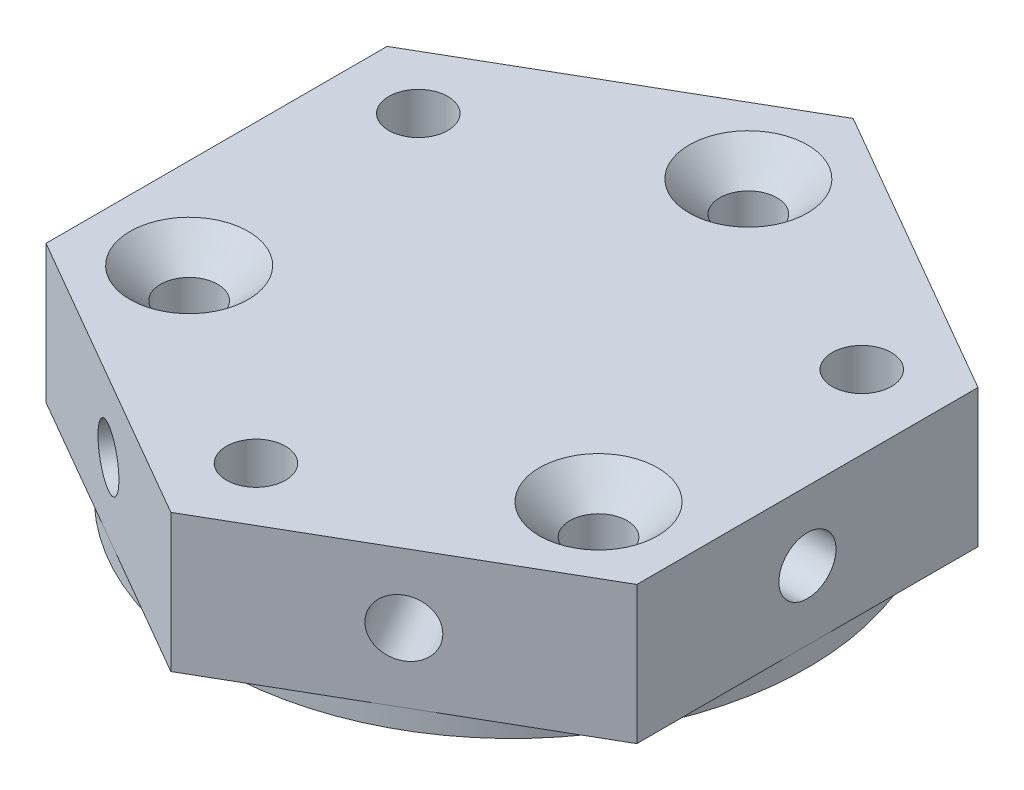
ISO-10303-21;
HEADER;
FILE_DESCRIPTION(('STEP AP214'),'2;1');
FILE_NAME('part.step','',(''),(''),'','','');
FILE_SCHEMA(('AUTOMOTIVE_DESIGN { 1 0 10303 214 1 1 1 1 }'));
ENDSEC;
DATA;
#1=APPLICATION_CONTEXT('core data for automotive mechanical design processes');
#2=APPLICATION_PROTOCOL_DEFINITION('international standard','automotive_design',2000,#1);
#3=PRODUCT_CONTEXT('',#1,'mechanical');
#4=PRODUCT('Part','Part','',(#3));
#5=PRODUCT_RELATED_PRODUCT_CATEGORY('part','',(#4));
#6=PRODUCT_DEFINITION_FORMATION('','',#4);
#7=PRODUCT_DEFINITION_CONTEXT('part definition',#1,'design');
#8=PRODUCT_DEFINITION('design','',#6,#7);
#9=PRODUCT_DEFINITION_SHAPE('','',#8);
#10=(LENGTH_UNIT() NAMED_UNIT(*) SI_UNIT(.MILLI.,.METRE.));
#11=(NAMED_UNIT(*) PLANE_ANGLE_UNIT() SI_UNIT($,.RADIAN.));
#12=(NAMED_UNIT(*) SI_UNIT($,.STERADIAN.) SOLID_ANGLE_UNIT());
#13=UNCERTAINTY_MEASURE_WITH_UNIT(LENGTH_MEASURE(1.E-05),#10,'distance_accuracy_value','');
#14=(GEOMETRIC_REPRESENTATION_CONTEXT(3) GLOBAL_UNCERTAINTY_ASSIGNED_CONTEXT((#13)) GLOBAL_UNIT_ASSIGNED_CONTEXT((#10,
#11,#12)) REPRESENTATION_CONTEXT('',''));
#15=CARTESIAN_POINT('',(0.,0.,0.));
#16=DIRECTION('',(0.,0.,1.));
#17=DIRECTION('',(1.,0.,0.));
#18=AXIS2_PLACEMENT_3D('',#15,#16,#17);
#19=CARTESIAN_POINT('',(0.,8.,0.));
#20=DIRECTION('',(0.,-1.,0.));
#21=DIRECTION('',(0.,0.,-1.));
#22=AXIS2_PLACEMENT_3D('',#19,#20,#21);
#23=CYLINDRICAL_SURFACE('',#22,15.);
#24=CARTESIAN_POINT('',(0.,0.,0.));
#25=DIRECTION('',(0.,1.,0.));
#26=DIRECTION('',(0.,0.,1.));
#27=AXIS2_PLACEMENT_3D('',#24,#25,#26);
#28=CIRCLE('',#27,15.);
#29=CARTESIAN_POINT('',(0.,0.,15.));
#30=VERTEX_POINT('',#29);
#31=EDGE_CURVE('E242',#30,#30,#28,.T.);
#32=ORIENTED_EDGE('',*,*,#31,.T.);
#33=EDGE_LOOP('',(#32));
#34=FACE_BOUND('',#33,.T.);
#35=CARTESIAN_POINT('',(0.,1.,0.));
#36=DIRECTION('',(0.,1.,0.));
#37=DIRECTION('',(0.,0.,1.));
#38=AXIS2_PLACEMENT_3D('',#35,#36,#37);
#39=CIRCLE('',#38,15.);
#40=CARTESIAN_POINT('',(7.5,1.,12.9903810567666));
#41=VERTEX_POINT('',#40);
#42=CARTESIAN_POINT('',(15.,1.,0.));
#43=VERTEX_POINT('',#42);
#44=EDGE_CURVE('E205',#41,#43,#39,.T.);
#45=ORIENTED_EDGE('',*,*,#44,.F.);
#46=CARTESIAN_POINT('',(-7.5,1.,12.9903810567666));
#47=VERTEX_POINT('',#46);
#48=EDGE_CURVE('E186',#47,#41,#39,.T.);
#49=ORIENTED_EDGE('',*,*,#48,.F.);
#50=CARTESIAN_POINT('',(-15.,1.,0.));
#51=VERTEX_POINT('',#50);
#52=EDGE_CURVE('E204',#51,#47,#39,.T.);
#53=ORIENTED_EDGE('',*,*,#52,.F.);
#54=CARTESIAN_POINT('',(-7.5,1.,-12.9903810567666));
#55=VERTEX_POINT('',#54);
#56=EDGE_CURVE('E473',#55,#51,#39,.T.);
#57=ORIENTED_EDGE('',*,*,#56,.F.);
#58=CARTESIAN_POINT('',(7.5,1.,-12.9903810567666));
#59=VERTEX_POINT('',#58);
#60=EDGE_CURVE('E63',#59,#55,#39,.T.);
#61=ORIENTED_EDGE('',*,*,#60,.F.);
#62=EDGE_CURVE('E58',#43,#59,#39,.T.);
#63=ORIENTED_EDGE('',*,*,#62,.F.);
#64=EDGE_LOOP('',(#45,#49,#53,#57,#61,#63));
#65=FACE_BOUND('',#64,.T.);
#66=ADVANCED_FACE('F41',(#34,#65),#23,.T.);
#67=CARTESIAN_POINT('',(0.,8.,0.));
#68=DIRECTION('',(0.,1.,0.));
#69=DIRECTION('',(0.,0.,1.));
#70=AXIS2_PLACEMENT_3D('',#67,#68,#69);
#71=PLANE('',#70);
#72=CARTESIAN_POINT('',(-10.3923048454133,8.,5.99999999999998));
#73=DIRECTION('',(0.,1.,0.));
#74=DIRECTION('',(0.,0.,1.));
#75=AXIS2_PLACEMENT_3D('',#72,#73,#74);
#76=CIRCLE('',#75,3.);
#77=CARTESIAN_POINT('',(-10.3923048454133,8.,8.99999999999998));
#78=VERTEX_POINT('',#77);
#79=EDGE_CURVE('E258',#78,#78,#76,.F.);
#80=ORIENTED_EDGE('',*,*,#79,.T.);
#81=EDGE_LOOP('',(#80));
#82=FACE_BOUND('',#81,.T.);
#83=CARTESIAN_POINT('',(0.,8.,-12.));
#84=DIRECTION('',(0.,1.,0.));
#85=DIRECTION('',(0.,0.,1.));
#86=AXIS2_PLACEMENT_3D('',#83,#84,#85);
#87=CIRCLE('',#86,3.);
#88=CARTESIAN_POINT('',(0.,8.,-9.));
#89=VERTEX_POINT('',#88);
#90=EDGE_CURVE('E254',#89,#89,#87,.F.);
#91=ORIENTED_EDGE('',*,*,#90,.T.);
#92=EDGE_LOOP('',(#91));
#93=FACE_BOUND('',#92,.T.);
#94=CARTESIAN_POINT('',(10.3923048454132,8.,6.00000000000005));
#95=DIRECTION('',(0.,1.,0.));
#96=DIRECTION('',(0.,0.,1.));
#97=AXIS2_PLACEMENT_3D('',#94,#95,#96);
#98=CIRCLE('',#97,3.);
#99=CARTESIAN_POINT('',(10.3923048454132,8.,9.00000000000005));
#100=VERTEX_POINT('',#99);
#101=EDGE_CURVE('E250',#100,#100,#98,.F.);
#102=ORIENTED_EDGE('',*,*,#101,.T.);
#103=EDGE_LOOP('',(#102));
#104=FACE_BOUND('',#103,.T.);
#105=CARTESIAN_POINT('',(0.,8.,13.));
#106=DIRECTION('',(0.,1.,0.));
#107=DIRECTION('',(0.,0.,1.));
#108=AXIS2_PLACEMENT_3D('',#105,#106,#107);
#109=CIRCLE('',#108,1.5);
#110=CARTESIAN_POINT('',(0.,8.,14.5));
#111=VERTEX_POINT('',#110);
#112=EDGE_CURVE('E215',#111,#111,#109,.T.);
#113=ORIENTED_EDGE('',*,*,#112,.F.);
#114=EDGE_LOOP('',(#113));
#115=FACE_BOUND('',#114,.T.);
#116=DIRECTION('',(0.866025403784439,0.,0.5));
#117=VECTOR('',#116,1.);
#118=CARTESIAN_POINT('',(-15.,8.,8.66025403784439));
#119=LINE('',#118,#117);
#120=CARTESIAN_POINT('',(-15.,8.,8.66025403784439));
#121=VERTEX_POINT('',#120);
#122=CARTESIAN_POINT('',(0.,8.,17.3205080756888));
#123=VERTEX_POINT('',#122);
#124=EDGE_CURVE('E174',#121,#123,#119,.T.);
#125=ORIENTED_EDGE('',*,*,#124,.T.);
#126=DIRECTION('',(0.866025403784439,0.,-0.5));
#127=VECTOR('',#126,1.);
#128=CARTESIAN_POINT('',(0.,8.,17.3205080756888));
#129=LINE('',#128,#127);
#130=CARTESIAN_POINT('',(15.,8.,8.66025403784439));
#131=VERTEX_POINT('',#130);
#132=EDGE_CURVE('E177',#123,#131,#129,.T.);
#133=ORIENTED_EDGE('',*,*,#132,.T.);
#134=DIRECTION('',(0.,0.,-1.));
#135=VECTOR('',#134,1.);
#136=CARTESIAN_POINT('',(15.,8.,8.66025403784439));
#137=LINE('',#136,#135);
#138=CARTESIAN_POINT('',(15.,8.,-8.6602540378444));
#139=VERTEX_POINT('',#138);
#140=EDGE_CURVE('E125',#131,#139,#137,.T.);
#141=ORIENTED_EDGE('',*,*,#140,.T.);
#142=DIRECTION('',(-0.866025403784439,0.,-0.5));
#143=VECTOR('',#142,1.);
#144=CARTESIAN_POINT('',(15.,8.,-8.6602540378444));
#145=LINE('',#144,#143);
#146=CARTESIAN_POINT('',(0.,8.,-17.3205080756888));
#147=VERTEX_POINT('',#146);
#148=EDGE_CURVE('E165',#139,#147,#145,.T.);
#149=ORIENTED_EDGE('',*,*,#148,.T.);
#150=DIRECTION('',(-0.866025403784439,0.,0.5));
#151=VECTOR('',#150,1.);
#152=CARTESIAN_POINT('',(0.,8.,-17.3205080756888));
#153=LINE('',#152,#151);
#154=CARTESIAN_POINT('',(-15.,8.,-8.66025403784439));
#155=VERTEX_POINT('',#154);
#156=EDGE_CURVE('E132',#147,#155,#153,.T.);
#157=ORIENTED_EDGE('',*,*,#156,.T.);
#158=DIRECTION('',(0.,0.,1.));
#159=VECTOR('',#158,1.);
#160=CARTESIAN_POINT('',(-15.,8.,-8.66025403784439));
#161=LINE('',#160,#159);
#162=EDGE_CURVE('E171',#155,#121,#161,.T.);
#163=ORIENTED_EDGE('',*,*,#162,.T.);
#164=EDGE_LOOP('',(#125,#133,#141,#149,#157,#163));
#165=FACE_BOUND('',#164,.T.);
#166=CARTESIAN_POINT('',(-11.2583302491977,8.,-6.49999999999997));
#167=DIRECTION('',(0.,1.,0.));
#168=DIRECTION('',(0.,0.,1.));
#169=AXIS2_PLACEMENT_3D('',#166,#167,#168);
#170=CIRCLE('',#169,1.5);
#171=CARTESIAN_POINT('',(-11.2583302491977,8.,-4.99999999999997));
#172=VERTEX_POINT('',#171);
#173=EDGE_CURVE('E223',#172,#172,#170,.T.);
#174=ORIENTED_EDGE('',*,*,#173,.F.);
#175=EDGE_LOOP('',(#174));
#176=FACE_BOUND('',#175,.T.);
#177=CARTESIAN_POINT('',(11.2583302491977,8.,-6.50000000000005));
#178=DIRECTION('',(0.,1.,0.));
#179=DIRECTION('',(0.,0.,1.));
#180=AXIS2_PLACEMENT_3D('',#177,#178,#179);
#181=CIRCLE('',#180,1.5);
#182=CARTESIAN_POINT('',(11.2583302491977,8.,-5.00000000000005));
#183=VERTEX_POINT('',#182);
#184=EDGE_CURVE('E206',#183,#183,#181,.T.);
#185=ORIENTED_EDGE('',*,*,#184,.F.);
#186=EDGE_LOOP('',(#185));
#187=FACE_BOUND('',#186,.T.);
#188=ADVANCED_FACE('F283',(#82,#93,#104,#115,#165,#176,#187),#71,.T.);
#189=CARTESIAN_POINT('',(0.,0.,0.));
#190=DIRECTION('',(0.,1.,0.));
#191=DIRECTION('',(0.,0.,1.));
#192=AXIS2_PLACEMENT_3D('',#189,#190,#191);
#193=PLANE('',#192);
#194=ORIENTED_EDGE('',*,*,#31,.F.);
#195=EDGE_LOOP('',(#194));
#196=FACE_BOUND('',#195,.T.);
#197=CARTESIAN_POINT('',(0.,0.,-12.));
#198=DIRECTION('',(0.,1.,0.));
#199=DIRECTION('',(0.,0.,1.));
#200=AXIS2_PLACEMENT_3D('',#197,#198,#199);
#201=CIRCLE('',#200,1.45);
#202=CARTESIAN_POINT('',(0.,0.,-10.55));
#203=VERTEX_POINT('',#202);
#204=EDGE_CURVE('E238',#203,#203,#201,.T.);
#205=ORIENTED_EDGE('',*,*,#204,.T.);
#206=EDGE_LOOP('',(#205));
#207=FACE_BOUND('',#206,.T.);
#208=CARTESIAN_POINT('',(-10.3923048454133,0.,5.99999999999998));
#209=DIRECTION('',(0.,1.,0.));
#210=DIRECTION('',(0.,0.,1.));
#211=AXIS2_PLACEMENT_3D('',#208,#209,#210);
#212=CIRCLE('',#211,1.45);
#213=CARTESIAN_POINT('',(-10.3923048454133,0.,7.44999999999998));
#214=VERTEX_POINT('',#213);
#215=EDGE_CURVE('E234',#214,#214,#212,.T.);
#216=ORIENTED_EDGE('',*,*,#215,.T.);
#217=EDGE_LOOP('',(#216));
#218=FACE_BOUND('',#217,.T.);
#219=CARTESIAN_POINT('',(10.3923048454132,0.,6.00000000000005));
#220=DIRECTION('',(0.,1.,0.));
#221=DIRECTION('',(0.,0.,1.));
#222=AXIS2_PLACEMENT_3D('',#219,#220,#221);
#223=CIRCLE('',#222,1.45);
#224=CARTESIAN_POINT('',(10.3923048454132,0.,7.45000000000005));
#225=VERTEX_POINT('',#224);
#226=EDGE_CURVE('E227',#225,#225,#223,.T.);
#227=ORIENTED_EDGE('',*,*,#226,.T.);
#228=EDGE_LOOP('',(#227));
#229=FACE_BOUND('',#228,.T.);
#230=CARTESIAN_POINT('',(-11.2583302491977,0.,-6.49999999999997));
#231=DIRECTION('',(0.,1.,0.));
#232=DIRECTION('',(0.,0.,1.));
#233=AXIS2_PLACEMENT_3D('',#230,#231,#232);
#234=CIRCLE('',#233,1.5);
#235=CARTESIAN_POINT('',(-11.2583302491977,0.,-4.99999999999997));
#236=VERTEX_POINT('',#235);
#237=EDGE_CURVE('E219',#236,#236,#234,.T.);
#238=ORIENTED_EDGE('',*,*,#237,.T.);
#239=EDGE_LOOP('',(#238));
#240=FACE_BOUND('',#239,.T.);
#241=CARTESIAN_POINT('',(0.,0.,13.));
#242=DIRECTION('',(0.,1.,0.));
#243=DIRECTION('',(0.,0.,1.));
#244=AXIS2_PLACEMENT_3D('',#241,#242,#243);
#245=CIRCLE('',#244,1.5);
#246=CARTESIAN_POINT('',(0.,0.,14.5));
#247=VERTEX_POINT('',#246);
#248=EDGE_CURVE('E210',#247,#247,#245,.T.);
#249=ORIENTED_EDGE('',*,*,#248,.T.);
#250=EDGE_LOOP('',(#249));
#251=FACE_BOUND('',#250,.T.);
#252=CARTESIAN_POINT('',(11.2583302491977,0.,-6.50000000000005));
#253=DIRECTION('',(0.,1.,0.));
#254=DIRECTION('',(0.,0.,1.));
#255=AXIS2_PLACEMENT_3D('',#252,#253,#254);
#256=CIRCLE('',#255,1.5);
#257=CARTESIAN_POINT('',(11.2583302491977,0.,-5.00000000000005));
#258=VERTEX_POINT('',#257);
#259=EDGE_CURVE('E211',#258,#258,#256,.T.);
#260=ORIENTED_EDGE('',*,*,#259,.T.);
#261=EDGE_LOOP('',(#260));
#262=FACE_BOUND('',#261,.T.);
#263=ADVANCED_FACE('F289',(#196,#207,#218,#229,#240,#251,#262),#193,.F.);
#264=CARTESIAN_POINT('',(0.,8.,-12.));
#265=DIRECTION('',(0.,-1.,0.));
#266=DIRECTION('',(0.,0.,-1.));
#267=AXIS2_PLACEMENT_3D('',#264,#265,#266);
#268=CYLINDRICAL_SURFACE('',#267,1.45);
#269=CARTESIAN_POINT('',(0.,6.45,-12.));
#270=DIRECTION('',(0.,1.,0.));
#271=DIRECTION('',(0.,0.,1.));
#272=AXIS2_PLACEMENT_3D('',#269,#270,#271);
#273=CIRCLE('',#272,1.45);
#274=CARTESIAN_POINT('',(0.,6.45,-10.55));
#275=VERTEX_POINT('',#274);
#276=EDGE_CURVE('E51',#275,#275,#273,.T.);
#277=ORIENTED_EDGE('',*,*,#276,.T.);
#278=EDGE_LOOP('',(#277));
#279=FACE_BOUND('',#278,.T.);
#280=ORIENTED_EDGE('',*,*,#204,.F.);
#281=EDGE_LOOP('',(#280));
#282=FACE_BOUND('',#281,.T.);
#283=ADVANCED_FACE('F265',(#279,#282),#268,.F.);
#284=CARTESIAN_POINT('',(-10.3923048454133,8.,5.99999999999998));
#285=DIRECTION('',(0.,-1.,0.));
#286=DIRECTION('',(0.,0.,-1.));
#287=AXIS2_PLACEMENT_3D('',#284,#285,#286);
#288=CYLINDRICAL_SURFACE('',#287,1.45);
#289=CARTESIAN_POINT('',(-10.3923048454133,6.45,5.99999999999998));
#290=DIRECTION('',(0.,1.,0.));
#291=DIRECTION('',(0.,0.,1.));
#292=AXIS2_PLACEMENT_3D('',#289,#290,#291);
#293=CIRCLE('',#292,1.45);
#294=CARTESIAN_POINT('',(-10.3923048454133,6.45,7.44999999999998));
#295=VERTEX_POINT('',#294);
#296=EDGE_CURVE('E246',#295,#295,#293,.T.);
#297=ORIENTED_EDGE('',*,*,#296,.T.);
#298=EDGE_LOOP('',(#297));
#299=FACE_BOUND('',#298,.T.);
#300=ORIENTED_EDGE('',*,*,#215,.F.);
#301=EDGE_LOOP('',(#300));
#302=FACE_BOUND('',#301,.T.);
#303=ADVANCED_FACE('F305',(#299,#302),#288,.F.);
#304=CARTESIAN_POINT('',(10.3923048454132,8.,6.00000000000005));
#305=DIRECTION('',(0.,-1.,0.));
#306=DIRECTION('',(0.,0.,-1.));
#307=AXIS2_PLACEMENT_3D('',#304,#305,#306);
#308=CYLINDRICAL_SURFACE('',#307,1.45);
#309=CARTESIAN_POINT('',(10.3923048454132,6.45,6.00000000000005));
#310=DIRECTION('',(0.,1.,0.));
#311=DIRECTION('',(0.,0.,1.));
#312=AXIS2_PLACEMENT_3D('',#309,#310,#311);
#313=CIRCLE('',#312,1.45);
#314=CARTESIAN_POINT('',(10.3923048454132,6.45,7.45000000000005));
#315=VERTEX_POINT('',#314);
#316=EDGE_CURVE('E11',#315,#315,#313,.T.);
#317=ORIENTED_EDGE('',*,*,#316,.T.);
#318=EDGE_LOOP('',(#317));
#319=FACE_BOUND('',#318,.T.);
#320=ORIENTED_EDGE('',*,*,#226,.F.);
#321=EDGE_LOOP('',(#320));
#322=FACE_BOUND('',#321,.T.);
#323=ADVANCED_FACE('F308',(#319,#322),#308,.F.);
#324=CARTESIAN_POINT('',(-11.2583302491977,8.,-6.49999999999997));
#325=DIRECTION('',(0.,-1.,0.));
#326=DIRECTION('',(0.,0.,-1.));
#327=AXIS2_PLACEMENT_3D('',#324,#325,#326);
#328=CYLINDRICAL_SURFACE('',#327,1.5);
#329=ORIENTED_EDGE('',*,*,#173,.T.);
#330=EDGE_LOOP('',(#329));
#331=FACE_BOUND('',#330,.T.);
#332=ORIENTED_EDGE('',*,*,#237,.F.);
#333=EDGE_LOOP('',(#332));
#334=FACE_BOUND('',#333,.T.);
#335=ADVANCED_FACE('F312',(#331,#334),#328,.F.);
#336=CARTESIAN_POINT('',(0.,8.,13.));
#337=DIRECTION('',(0.,-1.,0.));
#338=DIRECTION('',(0.,0.,-1.));
#339=AXIS2_PLACEMENT_3D('',#336,#337,#338);
#340=CYLINDRICAL_SURFACE('',#339,1.5);
#341=ORIENTED_EDGE('',*,*,#112,.T.);
#342=EDGE_LOOP('',(#341));
#343=FACE_BOUND('',#342,.T.);
#344=ORIENTED_EDGE('',*,*,#248,.F.);
#345=EDGE_LOOP('',(#344));
#346=FACE_BOUND('',#345,.T.);
#347=ADVANCED_FACE('F316',(#343,#346),#340,.F.);
#348=CARTESIAN_POINT('',(11.2583302491977,8.,-6.50000000000005));
#349=DIRECTION('',(0.,-1.,0.));
#350=DIRECTION('',(0.,0.,-1.));
#351=AXIS2_PLACEMENT_3D('',#348,#349,#350);
#352=CYLINDRICAL_SURFACE('',#351,1.5);
#353=ORIENTED_EDGE('',*,*,#184,.T.);
#354=EDGE_LOOP('',(#353));
#355=FACE_BOUND('',#354,.T.);
#356=ORIENTED_EDGE('',*,*,#259,.F.);
#357=EDGE_LOOP('',(#356));
#358=FACE_BOUND('',#357,.T.);
#359=ADVANCED_FACE('F320',(#355,#358),#352,.F.);
#360=CARTESIAN_POINT('',(15.,1.,-8.6602540378444));
#361=DIRECTION('',(0.5,0.,-0.866025403784439));
#362=DIRECTION('',(-0.866025403784439,0.,-0.5));
#363=AXIS2_PLACEMENT_3D('',#360,#361,#362);
#364=PLANE('',#363);
#365=CARTESIAN_POINT('',(7.5,4.5,-12.9903810567666));
#366=DIRECTION('',(0.5,0.,-0.866025403784439));
#367=DIRECTION('',(-0.866025403784439,0.,-0.5));
#368=AXIS2_PLACEMENT_3D('',#365,#366,#367);
#369=CIRCLE('',#368,1.45);
#370=CARTESIAN_POINT('',(6.24426316451256,4.5,-13.7153810567666));
#371=VERTEX_POINT('',#370);
#372=EDGE_CURVE('E405',#371,#371,#369,.T.);
#373=ORIENTED_EDGE('',*,*,#372,.F.);
#374=EDGE_LOOP('',(#373));
#375=FACE_BOUND('',#374,.T.);
#376=DIRECTION('',(-0.866025403784439,0.,-0.5));
#377=VECTOR('',#376,1.);
#378=CARTESIAN_POINT('',(15.,1.,-8.6602540378444));
#379=LINE('',#378,#377);
#380=CARTESIAN_POINT('',(15.,1.,-8.6602540378444));
#381=VERTEX_POINT('',#380);
#382=EDGE_CURVE('E121',#381,#59,#379,.T.);
#383=ORIENTED_EDGE('',*,*,#382,.T.);
#384=CARTESIAN_POINT('',(0.,1.,-17.3205080756888));
#385=VERTEX_POINT('',#384);
#386=EDGE_CURVE('E113',#59,#385,#379,.T.);
#387=ORIENTED_EDGE('',*,*,#386,.T.);
#388=DIRECTION('',(0.,1.,0.));
#389=VECTOR('',#388,1.);
#390=CARTESIAN_POINT('',(0.,1.,-17.3205080756888));
#391=LINE('',#390,#389);
#392=EDGE_CURVE('E117',#385,#147,#391,.T.);
#393=ORIENTED_EDGE('',*,*,#392,.T.);
#394=ORIENTED_EDGE('',*,*,#148,.F.);
#395=DIRECTION('',(0.,1.,0.));
#396=VECTOR('',#395,1.);
#397=CARTESIAN_POINT('',(15.,1.,-8.6602540378444));
#398=LINE('',#397,#396);
#399=EDGE_CURVE('E182',#381,#139,#398,.T.);
#400=ORIENTED_EDGE('',*,*,#399,.F.);
#401=EDGE_LOOP('',(#383,#387,#393,#394,#400));
#402=FACE_BOUND('',#401,.T.);
#403=ADVANCED_FACE('F115',(#375,#402),#364,.T.);
#404=CARTESIAN_POINT('',(15.,1.,8.66025403784439));
#405=DIRECTION('',(1.,0.,0.));
#406=DIRECTION('',(0.,0.,-1.));
#407=AXIS2_PLACEMENT_3D('',#404,#405,#406);
#408=PLANE('',#407);
#409=CARTESIAN_POINT('',(15.,4.5,0.));
#410=DIRECTION('',(1.,0.,0.));
#411=DIRECTION('',(0.,0.,-1.));
#412=AXIS2_PLACEMENT_3D('',#409,#410,#411);
#413=CIRCLE('',#412,1.45);
#414=CARTESIAN_POINT('',(15.,4.5,-1.45));
#415=VERTEX_POINT('',#414);
#416=EDGE_CURVE('E418',#415,#415,#413,.T.);
#417=ORIENTED_EDGE('',*,*,#416,.F.);
#418=EDGE_LOOP('',(#417));
#419=FACE_BOUND('',#418,.T.);
#420=DIRECTION('',(0.,0.,-1.));
#421=VECTOR('',#420,1.);
#422=CARTESIAN_POINT('',(15.,1.,8.66025403784439));
#423=LINE('',#422,#421);
#424=CARTESIAN_POINT('',(15.,1.,8.66025403784439));
#425=VERTEX_POINT('',#424);
#426=EDGE_CURVE('E135',#425,#43,#423,.T.);
#427=ORIENTED_EDGE('',*,*,#426,.T.);
#428=EDGE_CURVE('E161',#43,#381,#423,.T.);
#429=ORIENTED_EDGE('',*,*,#428,.T.);
#430=ORIENTED_EDGE('',*,*,#399,.T.);
#431=ORIENTED_EDGE('',*,*,#140,.F.);
#432=DIRECTION('',(0.,1.,0.));
#433=VECTOR('',#432,1.);
#434=CARTESIAN_POINT('',(15.,1.,8.66025403784439));
#435=LINE('',#434,#433);
#436=EDGE_CURVE('E187',#425,#131,#435,.T.);
#437=ORIENTED_EDGE('',*,*,#436,.F.);
#438=EDGE_LOOP('',(#427,#429,#430,#431,#437));
#439=FACE_BOUND('',#438,.T.);
#440=ADVANCED_FACE('F327',(#419,#439),#408,.T.);
#441=CARTESIAN_POINT('',(0.,1.,17.3205080756888));
#442=DIRECTION('',(0.5,0.,0.866025403784439));
#443=DIRECTION('',(0.866025403784439,0.,-0.5));
#444=AXIS2_PLACEMENT_3D('',#441,#442,#443);
#445=PLANE('',#444);
#446=CARTESIAN_POINT('',(7.5,4.5,12.9903810567666));
#447=DIRECTION('',(0.5,0.,0.866025403784438));
#448=DIRECTION('',(0.866025403784438,0.,-0.5));
#449=AXIS2_PLACEMENT_3D('',#446,#447,#448);
#450=CIRCLE('',#449,1.45);
#451=CARTESIAN_POINT('',(8.75573683548743,4.5,12.2653810567666));
#452=VERTEX_POINT('',#451);
#453=EDGE_CURVE('E440',#452,#452,#450,.T.);
#454=ORIENTED_EDGE('',*,*,#453,.F.);
#455=EDGE_LOOP('',(#454));
#456=FACE_BOUND('',#455,.T.);
#457=DIRECTION('',(0.866025403784439,0.,-0.5));
#458=VECTOR('',#457,1.);
#459=CARTESIAN_POINT('',(0.,1.,17.3205080756888));
#460=LINE('',#459,#458);
#461=CARTESIAN_POINT('',(0.,1.,17.3205080756888));
#462=VERTEX_POINT('',#461);
#463=EDGE_CURVE('E157',#462,#41,#460,.T.);
#464=ORIENTED_EDGE('',*,*,#463,.T.);
#465=EDGE_CURVE('E156',#41,#425,#460,.T.);
#466=ORIENTED_EDGE('',*,*,#465,.T.);
#467=ORIENTED_EDGE('',*,*,#436,.T.);
#468=ORIENTED_EDGE('',*,*,#132,.F.);
#469=DIRECTION('',(0.,1.,0.));
#470=VECTOR('',#469,1.);
#471=CARTESIAN_POINT('',(0.,1.,17.3205080756888));
#472=LINE('',#471,#470);
#473=EDGE_CURVE('E191',#462,#123,#472,.T.);
#474=ORIENTED_EDGE('',*,*,#473,.F.);
#475=EDGE_LOOP('',(#464,#466,#467,#468,#474));
#476=FACE_BOUND('',#475,.T.);
#477=ADVANCED_FACE('F340',(#456,#476),#445,.T.);
#478=CARTESIAN_POINT('',(-15.,1.,8.66025403784439));
#479=DIRECTION('',(-0.5,0.,0.866025403784439));
#480=DIRECTION('',(0.866025403784439,0.,0.5));
#481=AXIS2_PLACEMENT_3D('',#478,#479,#480);
#482=PLANE('',#481);
#483=CARTESIAN_POINT('',(-7.50000000000001,4.5,12.9903810567666));
#484=DIRECTION('',(-0.5,0.,0.866025403784438));
#485=DIRECTION('',(0.866025403784439,0.,0.5));
#486=AXIS2_PLACEMENT_3D('',#483,#484,#485);
#487=CIRCLE('',#486,1.45);
#488=CARTESIAN_POINT('',(-6.24426316451257,4.5,13.7153810567666));
#489=VERTEX_POINT('',#488);
#490=EDGE_CURVE('E432',#489,#489,#487,.T.);
#491=ORIENTED_EDGE('',*,*,#490,.F.);
#492=EDGE_LOOP('',(#491));
#493=FACE_BOUND('',#492,.T.);
#494=DIRECTION('',(0.866025403784439,0.,0.5));
#495=VECTOR('',#494,1.);
#496=CARTESIAN_POINT('',(-15.,1.,8.66025403784439));
#497=LINE('',#496,#495);
#498=CARTESIAN_POINT('',(-15.,1.,8.66025403784439));
#499=VERTEX_POINT('',#498);
#500=EDGE_CURVE('E152',#499,#47,#497,.T.);
#501=ORIENTED_EDGE('',*,*,#500,.T.);
#502=EDGE_CURVE('E151',#47,#462,#497,.T.);
#503=ORIENTED_EDGE('',*,*,#502,.T.);
#504=ORIENTED_EDGE('',*,*,#473,.T.);
#505=ORIENTED_EDGE('',*,*,#124,.F.);
#506=DIRECTION('',(0.,1.,0.));
#507=VECTOR('',#506,1.);
#508=CARTESIAN_POINT('',(-15.,1.,8.66025403784439));
#509=LINE('',#508,#507);
#510=EDGE_CURVE('E195',#499,#121,#509,.T.);
#511=ORIENTED_EDGE('',*,*,#510,.F.);
#512=EDGE_LOOP('',(#501,#503,#504,#505,#511));
#513=FACE_BOUND('',#512,.T.);
#514=ADVANCED_FACE('F336',(#493,#513),#482,.T.);
#515=CARTESIAN_POINT('',(-15.,1.,-8.66025403784439));
#516=DIRECTION('',(-1.,0.,0.));
#517=DIRECTION('',(0.,0.,1.));
#518=AXIS2_PLACEMENT_3D('',#515,#516,#517);
#519=PLANE('',#518);
#520=CARTESIAN_POINT('',(-15.,4.5,0.));
#521=DIRECTION('',(-1.,0.,0.));
#522=DIRECTION('',(0.,0.,1.));
#523=AXIS2_PLACEMENT_3D('',#520,#521,#522);
#524=CIRCLE('',#523,1.45);
#525=CARTESIAN_POINT('',(-15.,4.5,1.45));
#526=VERTEX_POINT('',#525);
#527=EDGE_CURVE('E424',#526,#526,#524,.T.);
#528=ORIENTED_EDGE('',*,*,#527,.F.);
#529=EDGE_LOOP('',(#528));
#530=FACE_BOUND('',#529,.T.);
#531=DIRECTION('',(0.,0.,1.));
#532=VECTOR('',#531,1.);
#533=CARTESIAN_POINT('',(-15.,1.,-8.66025403784439));
#534=LINE('',#533,#532);
#535=CARTESIAN_POINT('',(-15.,1.,-8.66025403784439));
#536=VERTEX_POINT('',#535);
#537=EDGE_CURVE('E145',#536,#51,#534,.T.);
#538=ORIENTED_EDGE('',*,*,#537,.T.);
#539=EDGE_CURVE('E140',#51,#499,#534,.T.);
#540=ORIENTED_EDGE('',*,*,#539,.T.);
#541=ORIENTED_EDGE('',*,*,#510,.T.);
#542=ORIENTED_EDGE('',*,*,#162,.F.);
#543=DIRECTION('',(0.,1.,0.));
#544=VECTOR('',#543,1.);
#545=CARTESIAN_POINT('',(-15.,1.,-8.66025403784439));
#546=LINE('',#545,#544);
#547=EDGE_CURVE('E134',#536,#155,#546,.T.);
#548=ORIENTED_EDGE('',*,*,#547,.F.);
#549=EDGE_LOOP('',(#538,#540,#541,#542,#548));
#550=FACE_BOUND('',#549,.T.);
#551=ADVANCED_FACE('F332',(#530,#550),#519,.T.);
#552=CARTESIAN_POINT('',(0.,1.,-17.3205080756888));
#553=DIRECTION('',(-0.5,0.,-0.866025403784439));
#554=DIRECTION('',(-0.866025403784439,0.,0.5));
#555=AXIS2_PLACEMENT_3D('',#552,#553,#554);
#556=PLANE('',#555);
#557=CARTESIAN_POINT('',(-7.50000000000001,4.5,-12.9903810567666));
#558=DIRECTION('',(-0.5,0.,-0.866025403784439));
#559=DIRECTION('',(-0.866025403784439,0.,0.5));
#560=AXIS2_PLACEMENT_3D('',#557,#558,#559);
#561=CIRCLE('',#560,1.5);
#562=CARTESIAN_POINT('',(-8.79903810567667,4.5,-12.2403810567666));
#563=VERTEX_POINT('',#562);
#564=EDGE_CURVE('E406',#563,#563,#561,.T.);
#565=ORIENTED_EDGE('',*,*,#564,.F.);
#566=EDGE_LOOP('',(#565));
#567=FACE_BOUND('',#566,.T.);
#568=DIRECTION('',(-0.866025403784439,0.,0.5));
#569=VECTOR('',#568,1.);
#570=CARTESIAN_POINT('',(0.,1.,-17.3205080756888));
#571=LINE('',#570,#569);
#572=EDGE_CURVE('E130',#385,#55,#571,.T.);
#573=ORIENTED_EDGE('',*,*,#572,.T.);
#574=EDGE_CURVE('E141',#55,#536,#571,.T.);
#575=ORIENTED_EDGE('',*,*,#574,.T.);
#576=ORIENTED_EDGE('',*,*,#547,.T.);
#577=ORIENTED_EDGE('',*,*,#156,.F.);
#578=ORIENTED_EDGE('',*,*,#392,.F.);
#579=EDGE_LOOP('',(#573,#575,#576,#577,#578));
#580=FACE_BOUND('',#579,.T.);
#581=ADVANCED_FACE('F129',(#567,#580),#556,.T.);
#582=CARTESIAN_POINT('',(0.,1.,0.));
#583=DIRECTION('',(0.,1.,0.));
#584=DIRECTION('',(0.,0.,1.));
#585=AXIS2_PLACEMENT_3D('',#582,#583,#584);
#586=PLANE('',#585);
#587=ORIENTED_EDGE('',*,*,#465,.F.);
#588=ORIENTED_EDGE('',*,*,#44,.T.);
#589=ORIENTED_EDGE('',*,*,#426,.F.);
#590=EDGE_LOOP('',(#587,#588,#589));
#591=FACE_BOUND('',#590,.T.);
#592=ADVANCED_FACE('F331',(#591),#586,.F.);
#593=ORIENTED_EDGE('',*,*,#428,.F.);
#594=ORIENTED_EDGE('',*,*,#62,.T.);
#595=ORIENTED_EDGE('',*,*,#382,.F.);
#596=EDGE_LOOP('',(#593,#594,#595));
#597=FACE_BOUND('',#596,.T.);
#598=ADVANCED_FACE('F350',(#597),#586,.F.);
#599=ORIENTED_EDGE('',*,*,#386,.F.);
#600=ORIENTED_EDGE('',*,*,#60,.T.);
#601=ORIENTED_EDGE('',*,*,#572,.F.);
#602=EDGE_LOOP('',(#599,#600,#601));
#603=FACE_BOUND('',#602,.T.);
#604=ADVANCED_FACE('F137',(#603),#586,.F.);
#605=ORIENTED_EDGE('',*,*,#574,.F.);
#606=ORIENTED_EDGE('',*,*,#56,.T.);
#607=ORIENTED_EDGE('',*,*,#537,.F.);
#608=EDGE_LOOP('',(#605,#606,#607));
#609=FACE_BOUND('',#608,.T.);
#610=ADVANCED_FACE('F488',(#609),#586,.F.);
#611=ORIENTED_EDGE('',*,*,#539,.F.);
#612=ORIENTED_EDGE('',*,*,#52,.T.);
#613=ORIENTED_EDGE('',*,*,#500,.F.);
#614=EDGE_LOOP('',(#611,#612,#613));
#615=FACE_BOUND('',#614,.T.);
#616=ADVANCED_FACE('F470',(#615),#586,.F.);
#617=ORIENTED_EDGE('',*,*,#502,.F.);
#618=ORIENTED_EDGE('',*,*,#48,.T.);
#619=ORIENTED_EDGE('',*,*,#463,.F.);
#620=EDGE_LOOP('',(#617,#618,#619));
#621=FACE_BOUND('',#620,.T.);
#622=ADVANCED_FACE('F352',(#621),#586,.F.);
#623=CARTESIAN_POINT('',(3.49999999999999,4.5,6.06217782649107));
#624=DIRECTION('',(0.5,0.,0.866025403784438));
#625=DIRECTION('',(0.866025403784438,0.,-0.5));
#626=AXIS2_PLACEMENT_3D('',#623,#624,#625);
#627=CYLINDRICAL_SURFACE('',#626,1.45);
#628=CARTESIAN_POINT('',(3.49999999999999,4.5,6.06217782649107));
#629=DIRECTION('',(0.5,0.,0.866025403784438));
#630=DIRECTION('',(0.866025403784438,0.,-0.5));
#631=AXIS2_PLACEMENT_3D('',#628,#629,#630);
#632=CIRCLE('',#631,1.45);
#633=CARTESIAN_POINT('',(4.75573683548743,4.5,5.33717782649107));
#634=VERTEX_POINT('',#633);
#635=EDGE_CURVE('E168',#634,#634,#632,.T.);
#636=ORIENTED_EDGE('',*,*,#635,.F.);
#637=EDGE_LOOP('',(#636));
#638=FACE_BOUND('',#637,.T.);
#639=ORIENTED_EDGE('',*,*,#453,.T.);
#640=EDGE_LOOP('',(#639));
#641=FACE_BOUND('',#640,.T.);
#642=ADVANCED_FACE('F353',(#638,#641),#627,.F.);
#643=CARTESIAN_POINT('',(3.49999999999999,4.5,6.06217782649107));
#644=DIRECTION('',(0.5,0.,0.866025403784438));
#645=DIRECTION('',(0.866025403784438,0.,-0.5));
#646=AXIS2_PLACEMENT_3D('',#643,#644,#645);
#647=PLANE('',#646);
#648=ORIENTED_EDGE('',*,*,#635,.T.);
#649=EDGE_LOOP('',(#648));
#650=FACE_BOUND('',#649,.T.);
#651=ADVANCED_FACE('F356',(#650),#647,.T.);
#652=CARTESIAN_POINT('',(-3.5,4.5,6.06217782649108));
#653=DIRECTION('',(-0.5,0.,0.866025403784439));
#654=DIRECTION('',(0.866025403784438,0.,0.5));
#655=AXIS2_PLACEMENT_3D('',#652,#653,#654);
#656=CYLINDRICAL_SURFACE('',#655,1.45);
#657=CARTESIAN_POINT('',(-3.5,4.5,6.06217782649108));
#658=DIRECTION('',(-0.5,0.,0.866025403784438));
#659=DIRECTION('',(0.866025403784439,0.,0.5));
#660=AXIS2_PLACEMENT_3D('',#657,#658,#659);
#661=CIRCLE('',#660,1.45);
#662=CARTESIAN_POINT('',(-2.24426316451257,4.5,6.78717782649108));
#663=VERTEX_POINT('',#662);
#664=EDGE_CURVE('E436',#663,#663,#661,.T.);
#665=ORIENTED_EDGE('',*,*,#664,.F.);
#666=EDGE_LOOP('',(#665));
#667=FACE_BOUND('',#666,.T.);
#668=ORIENTED_EDGE('',*,*,#490,.T.);
#669=EDGE_LOOP('',(#668));
#670=FACE_BOUND('',#669,.T.);
#671=ADVANCED_FACE('F360',(#667,#670),#656,.F.);
#672=CARTESIAN_POINT('',(-3.5,4.5,6.06217782649108));
#673=DIRECTION('',(-0.5,0.,0.866025403784438));
#674=DIRECTION('',(0.866025403784439,0.,0.5));
#675=AXIS2_PLACEMENT_3D('',#672,#673,#674);
#676=PLANE('',#675);
#677=ORIENTED_EDGE('',*,*,#664,.T.);
#678=EDGE_LOOP('',(#677));
#679=FACE_BOUND('',#678,.T.);
#680=ADVANCED_FACE('F364',(#679),#676,.T.);
#681=CARTESIAN_POINT('',(-6.99999999999999,4.5,0.));
#682=DIRECTION('',(-1.,0.,0.));
#683=DIRECTION('',(0.,0.,1.));
#684=AXIS2_PLACEMENT_3D('',#681,#682,#683);
#685=CYLINDRICAL_SURFACE('',#684,1.45);
#686=CARTESIAN_POINT('',(-6.99999999999999,4.5,0.));
#687=DIRECTION('',(-1.,0.,0.));
#688=DIRECTION('',(0.,0.,1.));
#689=AXIS2_PLACEMENT_3D('',#686,#687,#688);
#690=CIRCLE('',#689,1.45);
#691=CARTESIAN_POINT('',(-6.99999999999999,4.5,1.45));
#692=VERTEX_POINT('',#691);
#693=EDGE_CURVE('E428',#692,#692,#690,.T.);
#694=ORIENTED_EDGE('',*,*,#693,.F.);
#695=EDGE_LOOP('',(#694));
#696=FACE_BOUND('',#695,.T.);
#697=ORIENTED_EDGE('',*,*,#527,.T.);
#698=EDGE_LOOP('',(#697));
#699=FACE_BOUND('',#698,.T.);
#700=ADVANCED_FACE('F368',(#696,#699),#685,.F.);
#701=CARTESIAN_POINT('',(-6.99999999999999,4.5,0.));
#702=DIRECTION('',(-1.,0.,0.));
#703=DIRECTION('',(0.,0.,1.));
#704=AXIS2_PLACEMENT_3D('',#701,#702,#703);
#705=PLANE('',#704);
#706=ORIENTED_EDGE('',*,*,#693,.T.);
#707=EDGE_LOOP('',(#706));
#708=FACE_BOUND('',#707,.T.);
#709=ADVANCED_FACE('F372',(#708),#705,.T.);
#710=CARTESIAN_POINT('',(6.99999999999999,4.5,0.));
#711=DIRECTION('',(1.,0.,0.));
#712=DIRECTION('',(0.,0.,-1.));
#713=AXIS2_PLACEMENT_3D('',#710,#711,#712);
#714=CYLINDRICAL_SURFACE('',#713,1.45);
#715=CARTESIAN_POINT('',(6.99999999999999,4.5,0.));
#716=DIRECTION('',(1.,0.,0.));
#717=DIRECTION('',(0.,0.,-1.));
#718=AXIS2_PLACEMENT_3D('',#715,#716,#717);
#719=CIRCLE('',#718,1.45);
#720=CARTESIAN_POINT('',(6.99999999999999,4.5,-1.45));
#721=VERTEX_POINT('',#720);
#722=EDGE_CURVE('E420',#721,#721,#719,.T.);
#723=ORIENTED_EDGE('',*,*,#722,.F.);
#724=EDGE_LOOP('',(#723));
#725=FACE_BOUND('',#724,.T.);
#726=ORIENTED_EDGE('',*,*,#416,.T.);
#727=EDGE_LOOP('',(#726));
#728=FACE_BOUND('',#727,.T.);
#729=ADVANCED_FACE('F376',(#725,#728),#714,.F.);
#730=CARTESIAN_POINT('',(6.99999999999999,4.5,0.));
#731=DIRECTION('',(1.,0.,0.));
#732=DIRECTION('',(0.,0.,-1.));
#733=AXIS2_PLACEMENT_3D('',#730,#731,#732);
#734=PLANE('',#733);
#735=ORIENTED_EDGE('',*,*,#722,.T.);
#736=EDGE_LOOP('',(#735));
#737=FACE_BOUND('',#736,.T.);
#738=ADVANCED_FACE('F380',(#737),#734,.T.);
#739=CARTESIAN_POINT('',(3.5,4.5,-6.06217782649108));
#740=DIRECTION('',(0.5,0.,-0.866025403784439));
#741=DIRECTION('',(-0.866025403784439,0.,-0.5));
#742=AXIS2_PLACEMENT_3D('',#739,#740,#741);
#743=CYLINDRICAL_SURFACE('',#742,1.45);
#744=CARTESIAN_POINT('',(3.5,4.5,-6.06217782649108));
#745=DIRECTION('',(0.5,0.,-0.866025403784439));
#746=DIRECTION('',(-0.866025403784439,0.,-0.5));
#747=AXIS2_PLACEMENT_3D('',#744,#745,#746);
#748=CIRCLE('',#747,1.45);
#749=CARTESIAN_POINT('',(2.24426316451256,4.5,-6.78717782649108));
#750=VERTEX_POINT('',#749);
#751=EDGE_CURVE('E411',#750,#750,#748,.T.);
#752=ORIENTED_EDGE('',*,*,#751,.F.);
#753=EDGE_LOOP('',(#752));
#754=FACE_BOUND('',#753,.T.);
#755=ORIENTED_EDGE('',*,*,#372,.T.);
#756=EDGE_LOOP('',(#755));
#757=FACE_BOUND('',#756,.T.);
#758=ADVANCED_FACE('F384',(#754,#757),#743,.F.);
#759=CARTESIAN_POINT('',(3.5,4.5,-6.06217782649108));
#760=DIRECTION('',(0.5,0.,-0.866025403784439));
#761=DIRECTION('',(-0.866025403784439,0.,-0.5));
#762=AXIS2_PLACEMENT_3D('',#759,#760,#761);
#763=PLANE('',#762);
#764=ORIENTED_EDGE('',*,*,#751,.T.);
#765=EDGE_LOOP('',(#764));
#766=FACE_BOUND('',#765,.T.);
#767=ADVANCED_FACE('F388',(#766),#763,.T.);
#768=CARTESIAN_POINT('',(-3.5,4.5,-6.06217782649108));
#769=DIRECTION('',(-0.5,0.,-0.866025403784439));
#770=DIRECTION('',(-0.866025403784439,0.,0.5));
#771=AXIS2_PLACEMENT_3D('',#768,#769,#770);
#772=CYLINDRICAL_SURFACE('',#771,1.5);
#773=CARTESIAN_POINT('',(-3.5,4.5,-6.06217782649108));
#774=DIRECTION('',(-0.5,0.,-0.866025403784439));
#775=DIRECTION('',(-0.866025403784439,0.,0.5));
#776=AXIS2_PLACEMENT_3D('',#773,#774,#775);
#777=CIRCLE('',#776,1.5);
#778=CARTESIAN_POINT('',(-4.79903810567666,4.5,-5.31217782649108));
#779=VERTEX_POINT('',#778);
#780=EDGE_CURVE('E403',#779,#779,#777,.T.);
#781=ORIENTED_EDGE('',*,*,#780,.F.);
#782=EDGE_LOOP('',(#781));
#783=FACE_BOUND('',#782,.T.);
#784=ORIENTED_EDGE('',*,*,#564,.T.);
#785=EDGE_LOOP('',(#784));
#786=FACE_BOUND('',#785,.T.);
#787=ADVANCED_FACE('F392',(#783,#786),#772,.F.);
#788=CARTESIAN_POINT('',(-3.5,4.5,-6.06217782649108));
#789=DIRECTION('',(-0.5,0.,-0.866025403784439));
#790=DIRECTION('',(-0.866025403784439,0.,0.5));
#791=AXIS2_PLACEMENT_3D('',#788,#789,#790);
#792=PLANE('',#791);
#793=ORIENTED_EDGE('',*,*,#780,.T.);
#794=EDGE_LOOP('',(#793));
#795=FACE_BOUND('',#794,.T.);
#796=ADVANCED_FACE('F277',(#795),#792,.T.);
#797=CARTESIAN_POINT('',(-10.3923048454133,6.45,5.99999999999998));
#798=DIRECTION('',(0.,1.,0.));
#799=DIRECTION('',(0.,0.,1.));
#800=AXIS2_PLACEMENT_3D('',#797,#798,#799);
#801=CONICAL_SURFACE('',#800,1.45,0.785398163397449);
#802=ORIENTED_EDGE('',*,*,#79,.F.);
#803=EDGE_LOOP('',(#802));
#804=FACE_BOUND('',#803,.T.);
#805=ORIENTED_EDGE('',*,*,#296,.F.);
#806=EDGE_LOOP('',(#805));
#807=FACE_BOUND('',#806,.T.);
#808=ADVANCED_FACE('F270',(#804,#807),#801,.F.);
#809=CARTESIAN_POINT('',(0.,6.45,-12.));
#810=DIRECTION('',(0.,1.,0.));
#811=DIRECTION('',(0.,0.,1.));
#812=AXIS2_PLACEMENT_3D('',#809,#810,#811);
#813=CONICAL_SURFACE('',#812,1.45,0.785398163397449);
#814=ORIENTED_EDGE('',*,*,#90,.F.);
#815=EDGE_LOOP('',(#814));
#816=FACE_BOUND('',#815,.T.);
#817=ORIENTED_EDGE('',*,*,#276,.F.);
#818=EDGE_LOOP('',(#817));
#819=FACE_BOUND('',#818,.T.);
#820=ADVANCED_FACE('F268',(#816,#819),#813,.F.);
#821=CARTESIAN_POINT('',(10.3923048454132,6.45,6.00000000000005));
#822=DIRECTION('',(0.,1.,0.));
#823=DIRECTION('',(0.,0.,1.));
#824=AXIS2_PLACEMENT_3D('',#821,#822,#823);
#825=CONICAL_SURFACE('',#824,1.45,0.785398163397449);
#826=ORIENTED_EDGE('',*,*,#101,.F.);
#827=EDGE_LOOP('',(#826));
#828=FACE_BOUND('',#827,.T.);
#829=ORIENTED_EDGE('',*,*,#316,.F.);
#830=EDGE_LOOP('',(#829));
#831=FACE_BOUND('',#830,.T.);
#832=ADVANCED_FACE('F44',(#828,#831),#825,.F.);
#833=CLOSED_SHELL('',(#66,#188,#263,#283,#303,#323,#335,#347,#359,#403,#440,#477,#514,#551,#581,
#592,#598,#604,#610,#616,#622,#642,#651,#671,#680,#700,#709,#729,#738,#758,#767,#787,#796,#808,
#820,#832));
#834=MANIFOLD_SOLID_BREP('B2',#833);
#835=ADVANCED_BREP_SHAPE_REPRESENTATION('',(#18,#834),#14);
#836=SHAPE_DEFINITION_REPRESENTATION(#9,#835);
ENDSEC;
END-ISO-10303-21;
